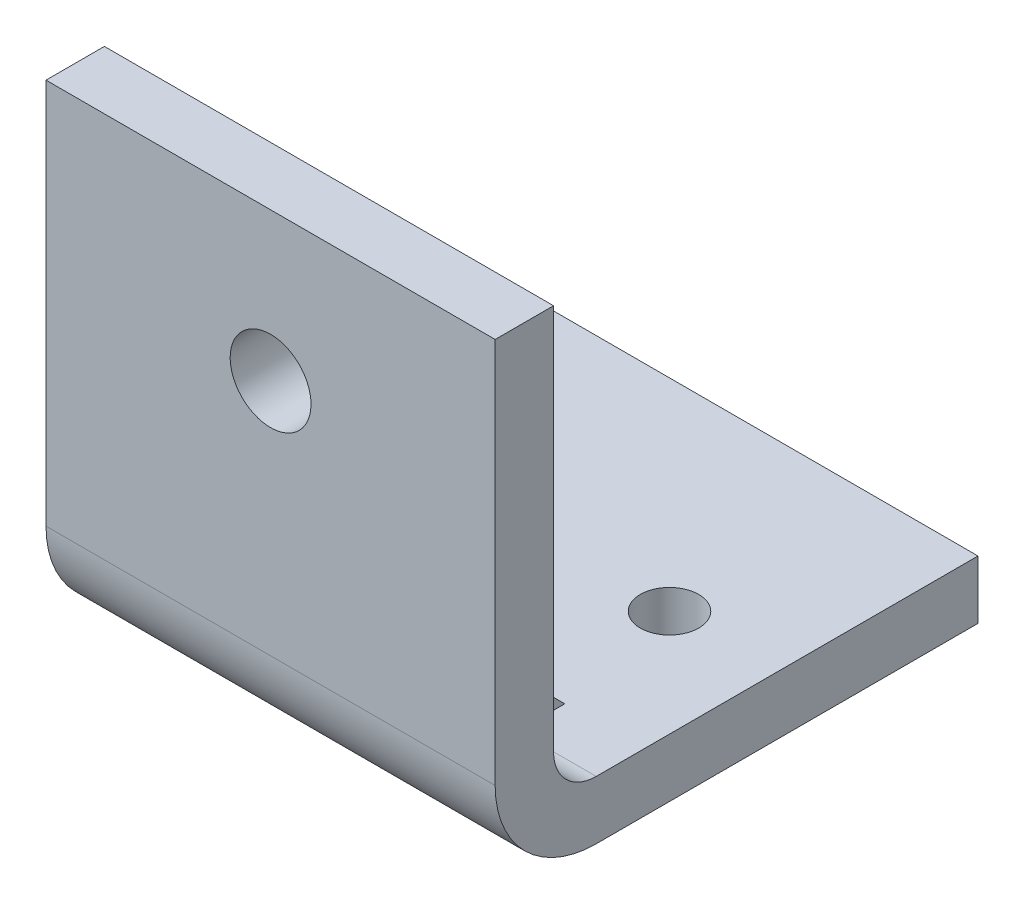
ISO-10303-21;
HEADER;
FILE_DESCRIPTION(('STEP AP214'),'2;1');
FILE_NAME('part.step','',(''),(''),'','','');
FILE_SCHEMA(('AUTOMOTIVE_DESIGN { 1 0 10303 214 1 1 1 1 }'));
ENDSEC;
DATA;
#1=APPLICATION_CONTEXT('core data for automotive mechanical design processes');
#2=APPLICATION_PROTOCOL_DEFINITION('international standard','automotive_design',2000,#1);
#3=PRODUCT_CONTEXT('',#1,'mechanical');
#4=PRODUCT('Part','Part','',(#3));
#5=PRODUCT_RELATED_PRODUCT_CATEGORY('part','',(#4));
#6=PRODUCT_DEFINITION_FORMATION('','',#4);
#7=PRODUCT_DEFINITION_CONTEXT('part definition',#1,'design');
#8=PRODUCT_DEFINITION('design','',#6,#7);
#9=PRODUCT_DEFINITION_SHAPE('','',#8);
#10=(LENGTH_UNIT() NAMED_UNIT(*) SI_UNIT(.MILLI.,.METRE.));
#11=(NAMED_UNIT(*) PLANE_ANGLE_UNIT() SI_UNIT($,.RADIAN.));
#12=(NAMED_UNIT(*) SI_UNIT($,.STERADIAN.) SOLID_ANGLE_UNIT());
#13=UNCERTAINTY_MEASURE_WITH_UNIT(LENGTH_MEASURE(1.E-05),#10,'distance_accuracy_value','');
#14=(GEOMETRIC_REPRESENTATION_CONTEXT(3) GLOBAL_UNCERTAINTY_ASSIGNED_CONTEXT((#13)) GLOBAL_UNIT_ASSIGNED_CONTEXT((#10,
#11,#12)) REPRESENTATION_CONTEXT('',''));
#15=CARTESIAN_POINT('',(0.,0.,0.));
#16=DIRECTION('',(0.,0.,1.));
#17=DIRECTION('',(1.,0.,0.));
#18=AXIS2_PLACEMENT_3D('',#15,#16,#17);
#19=CARTESIAN_POINT('',(50.,16.,-16.));
#20=DIRECTION('',(-1.,0.,0.));
#21=DIRECTION('',(0.,0.,1.));
#22=AXIS2_PLACEMENT_3D('',#19,#20,#21);
#23=CYLINDRICAL_SURFACE('',#22,9.5);
#24=DIRECTION('',(-1.,0.,0.));
#25=VECTOR('',#24,1.);
#26=CARTESIAN_POINT('',(50.,6.5,-16.0000000000001));
#27=LINE('',#26,#25);
#28=CARTESIAN_POINT('',(27.5,6.5,-16.0000000000001));
#29=VERTEX_POINT('',#28);
#30=CARTESIAN_POINT('',(-27.5,6.5,-16.0000000000001));
#31=VERTEX_POINT('',#30);
#32=EDGE_CURVE('E326',#29,#31,#27,.T.);
#33=ORIENTED_EDGE('',*,*,#32,.T.);
#34=CARTESIAN_POINT('',(-27.5,16.,-16.));
#35=DIRECTION('',(-1.,0.,0.));
#36=DIRECTION('',(0.,0.,1.));
#37=AXIS2_PLACEMENT_3D('',#34,#35,#36);
#38=CIRCLE('',#37,9.5);
#39=CARTESIAN_POINT('',(-27.5,16.0000000000001,-6.5));
#40=VERTEX_POINT('',#39);
#41=EDGE_CURVE('E157',#31,#40,#38,.T.);
#42=ORIENTED_EDGE('',*,*,#41,.T.);
#43=DIRECTION('',(-1.,0.,0.));
#44=VECTOR('',#43,1.);
#45=CARTESIAN_POINT('',(50.,16.0000000000001,-6.5));
#46=LINE('',#45,#44);
#47=CARTESIAN_POINT('',(27.5,16.0000000000001,-6.5));
#48=VERTEX_POINT('',#47);
#49=EDGE_CURVE('E322',#48,#40,#46,.T.);
#50=ORIENTED_EDGE('',*,*,#49,.F.);
#51=CARTESIAN_POINT('',(27.5,16.,-16.));
#52=DIRECTION('',(1.,0.,0.));
#53=DIRECTION('',(0.,0.,-1.));
#54=AXIS2_PLACEMENT_3D('',#51,#52,#53);
#55=CIRCLE('',#54,9.5);
#56=EDGE_CURVE('E67',#48,#29,#55,.T.);
#57=ORIENTED_EDGE('',*,*,#56,.T.);
#58=EDGE_LOOP('',(#33,#42,#50,#57));
#59=FACE_BOUND('',#58,.T.);
#60=ADVANCED_FACE('F43',(#59),#23,.F.);
#61=CARTESIAN_POINT('',(-32.5,16.,-16.));
#62=DIRECTION('',(-1.,0.,0.));
#63=DIRECTION('',(0.,0.,1.));
#64=AXIS2_PLACEMENT_3D('',#61,#62,#63);
#65=CIRCLE('',#64,9.5);
#66=CARTESIAN_POINT('',(-32.5,6.5,-16.0000000000001));
#67=VERTEX_POINT('',#66);
#68=CARTESIAN_POINT('',(-32.5,16.0000000000001,-6.5));
#69=VERTEX_POINT('',#68);
#70=EDGE_CURVE('E344',#67,#69,#65,.T.);
#71=ORIENTED_EDGE('',*,*,#70,.F.);
#72=CARTESIAN_POINT('',(-50.,6.5,-16.0000000000001));
#73=VERTEX_POINT('',#72);
#74=EDGE_CURVE('E321',#67,#73,#27,.T.);
#75=ORIENTED_EDGE('',*,*,#74,.T.);
#76=CARTESIAN_POINT('',(-50.,16.,-16.));
#77=DIRECTION('',(1.,0.,0.));
#78=DIRECTION('',(0.,0.,-1.));
#79=AXIS2_PLACEMENT_3D('',#76,#77,#78);
#80=CIRCLE('',#79,9.5);
#81=CARTESIAN_POINT('',(-50.,16.0000000000001,-6.5));
#82=VERTEX_POINT('',#81);
#83=EDGE_CURVE('E286',#82,#73,#80,.T.);
#84=ORIENTED_EDGE('',*,*,#83,.F.);
#85=EDGE_CURVE('E316',#69,#82,#46,.T.);
#86=ORIENTED_EDGE('',*,*,#85,.F.);
#87=EDGE_LOOP('',(#71,#75,#84,#86));
#88=FACE_BOUND('',#87,.T.);
#89=ADVANCED_FACE('F343',(#88),#23,.F.);
#90=CARTESIAN_POINT('',(50.,-6.5,-16.0000000000001));
#91=DIRECTION('',(0.,1.,0.));
#92=DIRECTION('',(0.,0.,1.));
#93=AXIS2_PLACEMENT_3D('',#90,#91,#92);
#94=PLANE('',#93);
#95=DIRECTION('',(-1.,0.,0.));
#96=VECTOR('',#95,1.);
#97=CARTESIAN_POINT('',(50.,-6.5,-16.0000000000001));
#98=LINE('',#97,#96);
#99=CARTESIAN_POINT('',(50.,-6.5,-16.0000000000001));
#100=VERTEX_POINT('',#99);
#101=CARTESIAN_POINT('',(-50.,-6.5,-16.0000000000001));
#102=VERTEX_POINT('',#101);
#103=EDGE_CURVE('E274',#100,#102,#98,.T.);
#104=ORIENTED_EDGE('',*,*,#103,.T.);
#105=DIRECTION('',(0.,0.,-1.));
#106=VECTOR('',#105,1.);
#107=CARTESIAN_POINT('',(-50.,-6.5,-16.0000000000001));
#108=LINE('',#107,#106);
#109=CARTESIAN_POINT('',(-50.,-6.5,-101.));
#110=VERTEX_POINT('',#109);
#111=EDGE_CURVE('E240',#102,#110,#108,.T.);
#112=ORIENTED_EDGE('',*,*,#111,.T.);
#113=DIRECTION('',(-1.,0.,0.));
#114=VECTOR('',#113,1.);
#115=CARTESIAN_POINT('',(50.,-6.5,-101.));
#116=LINE('',#115,#114);
#117=CARTESIAN_POINT('',(50.,-6.5,-101.));
#118=VERTEX_POINT('',#117);
#119=EDGE_CURVE('E11',#118,#110,#116,.T.);
#120=ORIENTED_EDGE('',*,*,#119,.F.);
#121=DIRECTION('',(0.,0.,-1.));
#122=VECTOR('',#121,1.);
#123=CARTESIAN_POINT('',(50.,-6.5,-16.0000000000001));
#124=LINE('',#123,#122);
#125=EDGE_CURVE('E244',#100,#118,#124,.T.);
#126=ORIENTED_EDGE('',*,*,#125,.F.);
#127=EDGE_LOOP('',(#104,#112,#120,#126));
#128=FACE_BOUND('',#127,.T.);
#129=CARTESIAN_POINT('',(26.3164053451294,-6.5,-56.));
#130=DIRECTION('',(0.,1.,0.));
#131=DIRECTION('',(0.,0.,1.));
#132=AXIS2_PLACEMENT_3D('',#129,#130,#131);
#133=CIRCLE('',#132,6.5);
#134=CARTESIAN_POINT('',(26.3164053451294,-6.5,-49.5));
#135=VERTEX_POINT('',#134);
#136=EDGE_CURVE('E220',#135,#135,#133,.T.);
#137=ORIENTED_EDGE('',*,*,#136,.T.);
#138=EDGE_LOOP('',(#137));
#139=FACE_BOUND('',#138,.T.);
#140=CARTESIAN_POINT('',(-23.6835946548706,-6.5,-56.));
#141=DIRECTION('',(0.,1.,0.));
#142=DIRECTION('',(0.,0.,1.));
#143=AXIS2_PLACEMENT_3D('',#140,#141,#142);
#144=CIRCLE('',#143,6.5);
#145=CARTESIAN_POINT('',(-23.6835946548706,-6.5,-49.5));
#146=VERTEX_POINT('',#145);
#147=EDGE_CURVE('E219',#146,#146,#144,.T.);
#148=ORIENTED_EDGE('',*,*,#147,.T.);
#149=EDGE_LOOP('',(#148));
#150=FACE_BOUND('',#149,.T.);
#151=ADVANCED_FACE('F45',(#128,#139,#150),#94,.F.);
#152=CARTESIAN_POINT('',(50.,6.5,-101.));
#153=DIRECTION('',(0.,0.,-1.));
#154=DIRECTION('',(-1.,0.,0.));
#155=AXIS2_PLACEMENT_3D('',#152,#153,#154);
#156=PLANE('',#155);
#157=DIRECTION('',(0.,-1.,0.));
#158=VECTOR('',#157,1.);
#159=CARTESIAN_POINT('',(-50.,6.5,-101.));
#160=LINE('',#159,#158);
#161=CARTESIAN_POINT('',(-50.,6.5,-101.));
#162=VERTEX_POINT('',#161);
#163=EDGE_CURVE('E278',#162,#110,#160,.T.);
#164=ORIENTED_EDGE('',*,*,#163,.F.);
#165=DIRECTION('',(-1.,0.,0.));
#166=VECTOR('',#165,1.);
#167=CARTESIAN_POINT('',(50.,6.5,-101.));
#168=LINE('',#167,#166);
#169=CARTESIAN_POINT('',(50.,6.5,-101.));
#170=VERTEX_POINT('',#169);
#171=EDGE_CURVE('E52',#170,#162,#168,.T.);
#172=ORIENTED_EDGE('',*,*,#171,.F.);
#173=DIRECTION('',(0.,-1.,0.));
#174=VECTOR('',#173,1.);
#175=CARTESIAN_POINT('',(50.,6.5,-101.));
#176=LINE('',#175,#174);
#177=EDGE_CURVE('E247',#170,#118,#176,.T.);
#178=ORIENTED_EDGE('',*,*,#177,.T.);
#179=ORIENTED_EDGE('',*,*,#119,.T.);
#180=EDGE_LOOP('',(#164,#172,#178,#179));
#181=FACE_BOUND('',#180,.T.);
#182=ADVANCED_FACE('F333',(#181),#156,.T.);
#183=CARTESIAN_POINT('',(50.,6.5,-16.0000000000001));
#184=DIRECTION('',(0.,1.,0.));
#185=DIRECTION('',(0.,0.,1.));
#186=AXIS2_PLACEMENT_3D('',#183,#184,#185);
#187=PLANE('',#186);
#188=DIRECTION('',(0.,0.,1.));
#189=VECTOR('',#188,1.);
#190=CARTESIAN_POINT('',(-32.5,6.5,-16.0000000000001));
#191=LINE('',#190,#189);
#192=CARTESIAN_POINT('',(-32.5,6.5,-26.5));
#193=VERTEX_POINT('',#192);
#194=EDGE_CURVE('E180',#193,#67,#191,.T.);
#195=ORIENTED_EDGE('',*,*,#194,.F.);
#196=DIRECTION('',(-1.,0.,0.));
#197=VECTOR('',#196,1.);
#198=CARTESIAN_POINT('',(50.,6.5,-26.5));
#199=LINE('',#198,#197);
#200=CARTESIAN_POINT('',(-27.5,6.5,-26.5));
#201=VERTEX_POINT('',#200);
#202=EDGE_CURVE('E168',#201,#193,#199,.T.);
#203=ORIENTED_EDGE('',*,*,#202,.F.);
#204=DIRECTION('',(0.,0.,1.));
#205=VECTOR('',#204,1.);
#206=CARTESIAN_POINT('',(-27.5,6.5,-16.0000000000001));
#207=LINE('',#206,#205);
#208=EDGE_CURVE('E154',#201,#31,#207,.T.);
#209=ORIENTED_EDGE('',*,*,#208,.T.);
#210=ORIENTED_EDGE('',*,*,#32,.F.);
#211=DIRECTION('',(0.,0.,-1.));
#212=VECTOR('',#211,1.);
#213=CARTESIAN_POINT('',(27.5,6.5,-16.0000000000001));
#214=LINE('',#213,#212);
#215=CARTESIAN_POINT('',(27.5,6.5,-26.5));
#216=VERTEX_POINT('',#215);
#217=EDGE_CURVE('E200',#29,#216,#214,.T.);
#218=ORIENTED_EDGE('',*,*,#217,.T.);
#219=DIRECTION('',(1.,0.,0.));
#220=VECTOR('',#219,1.);
#221=CARTESIAN_POINT('',(50.,6.5,-26.5));
#222=LINE('',#221,#220);
#223=CARTESIAN_POINT('',(32.5,6.5,-26.5));
#224=VERTEX_POINT('',#223);
#225=EDGE_CURVE('E216',#224,#216,#222,.F.);
#226=ORIENTED_EDGE('',*,*,#225,.F.);
#227=DIRECTION('',(0.,0.,-1.));
#228=VECTOR('',#227,1.);
#229=CARTESIAN_POINT('',(32.5,6.5,-16.0000000000001));
#230=LINE('',#229,#228);
#231=CARTESIAN_POINT('',(32.5,6.5,-16.0000000000001));
#232=VERTEX_POINT('',#231);
#233=EDGE_CURVE('E210',#232,#224,#230,.T.);
#234=ORIENTED_EDGE('',*,*,#233,.F.);
#235=CARTESIAN_POINT('',(50.,6.5,-16.0000000000001));
#236=VERTEX_POINT('',#235);
#237=EDGE_CURVE('E323',#236,#232,#27,.T.);
#238=ORIENTED_EDGE('',*,*,#237,.F.);
#239=DIRECTION('',(0.,0.,-1.));
#240=VECTOR('',#239,1.);
#241=CARTESIAN_POINT('',(50.,6.5,-16.0000000000001));
#242=LINE('',#241,#240);
#243=EDGE_CURVE('E252',#236,#170,#242,.T.);
#244=ORIENTED_EDGE('',*,*,#243,.T.);
#245=ORIENTED_EDGE('',*,*,#171,.T.);
#246=DIRECTION('',(0.,0.,-1.));
#247=VECTOR('',#246,1.);
#248=CARTESIAN_POINT('',(-50.,6.5,-16.0000000000001));
#249=LINE('',#248,#247);
#250=EDGE_CURVE('E282',#73,#162,#249,.T.);
#251=ORIENTED_EDGE('',*,*,#250,.F.);
#252=ORIENTED_EDGE('',*,*,#74,.F.);
#253=EDGE_LOOP('',(#195,#203,#209,#210,#218,#226,#234,#238,#244,#245,#251,#252));
#254=FACE_BOUND('',#253,.T.);
#255=CARTESIAN_POINT('',(26.3164053451294,6.5,-56.));
#256=DIRECTION('',(0.,1.,0.));
#257=DIRECTION('',(0.,0.,1.));
#258=AXIS2_PLACEMENT_3D('',#255,#256,#257);
#259=CIRCLE('',#258,6.5);
#260=CARTESIAN_POINT('',(26.3164053451294,6.5,-49.5));
#261=VERTEX_POINT('',#260);
#262=EDGE_CURVE('E225',#261,#261,#259,.T.);
#263=ORIENTED_EDGE('',*,*,#262,.F.);
#264=EDGE_LOOP('',(#263));
#265=FACE_BOUND('',#264,.T.);
#266=CARTESIAN_POINT('',(-23.6835946548706,6.5,-56.));
#267=DIRECTION('',(0.,1.,0.));
#268=DIRECTION('',(0.,0.,1.));
#269=AXIS2_PLACEMENT_3D('',#266,#267,#268);
#270=CIRCLE('',#269,6.5);
#271=CARTESIAN_POINT('',(-23.6835946548706,6.5,-49.5));
#272=VERTEX_POINT('',#271);
#273=EDGE_CURVE('E229',#272,#272,#270,.T.);
#274=ORIENTED_EDGE('',*,*,#273,.F.);
#275=EDGE_LOOP('',(#274));
#276=FACE_BOUND('',#275,.T.);
#277=ADVANCED_FACE('F177',(#254,#265,#276),#187,.T.);
#278=CARTESIAN_POINT('',(32.5,16.,-16.));
#279=DIRECTION('',(1.,0.,0.));
#280=DIRECTION('',(0.,0.,-1.));
#281=AXIS2_PLACEMENT_3D('',#278,#279,#280);
#282=CIRCLE('',#281,9.5);
#283=CARTESIAN_POINT('',(32.5,16.0000000000001,-6.5));
#284=VERTEX_POINT('',#283);
#285=EDGE_CURVE('E207',#284,#232,#282,.T.);
#286=ORIENTED_EDGE('',*,*,#285,.F.);
#287=CARTESIAN_POINT('',(50.,16.0000000000001,-6.5));
#288=VERTEX_POINT('',#287);
#289=EDGE_CURVE('E317',#288,#284,#46,.T.);
#290=ORIENTED_EDGE('',*,*,#289,.F.);
#291=CARTESIAN_POINT('',(50.,16.,-16.));
#292=DIRECTION('',(1.,0.,0.));
#293=DIRECTION('',(0.,0.,-1.));
#294=AXIS2_PLACEMENT_3D('',#291,#292,#293);
#295=CIRCLE('',#294,9.5);
#296=EDGE_CURVE('E256',#288,#236,#295,.T.);
#297=ORIENTED_EDGE('',*,*,#296,.T.);
#298=ORIENTED_EDGE('',*,*,#237,.T.);
#299=EDGE_LOOP('',(#286,#290,#297,#298));
#300=FACE_BOUND('',#299,.T.);
#301=ADVANCED_FACE('F367',(#300),#23,.F.);
#302=CARTESIAN_POINT('',(50.,102.,-6.5));
#303=DIRECTION('',(0.,0.,-1.));
#304=DIRECTION('',(0.,1.,0.));
#305=AXIS2_PLACEMENT_3D('',#302,#303,#304);
#306=PLANE('',#305);
#307=DIRECTION('',(0.,1.,0.));
#308=VECTOR('',#307,1.);
#309=CARTESIAN_POINT('',(-32.5,102.,-6.5));
#310=LINE('',#309,#308);
#311=CARTESIAN_POINT('',(-32.5,26.5,-6.5));
#312=VERTEX_POINT('',#311);
#313=EDGE_CURVE('E163',#69,#312,#310,.T.);
#314=ORIENTED_EDGE('',*,*,#313,.F.);
#315=ORIENTED_EDGE('',*,*,#85,.T.);
#316=DIRECTION('',(0.,-1.,0.));
#317=VECTOR('',#316,1.);
#318=CARTESIAN_POINT('',(-50.,102.,-6.5));
#319=LINE('',#318,#317);
#320=CARTESIAN_POINT('',(-50.,102.,-6.5));
#321=VERTEX_POINT('',#320);
#322=EDGE_CURVE('E290',#321,#82,#319,.T.);
#323=ORIENTED_EDGE('',*,*,#322,.F.);
#324=DIRECTION('',(-1.,0.,0.));
#325=VECTOR('',#324,1.);
#326=CARTESIAN_POINT('',(50.,102.,-6.5));
#327=LINE('',#326,#325);
#328=CARTESIAN_POINT('',(50.,102.,-6.5));
#329=VERTEX_POINT('',#328);
#330=EDGE_CURVE('E313',#329,#321,#327,.T.);
#331=ORIENTED_EDGE('',*,*,#330,.F.);
#332=DIRECTION('',(0.,-1.,0.));
#333=VECTOR('',#332,1.);
#334=CARTESIAN_POINT('',(50.,102.,-6.5));
#335=LINE('',#334,#333);
#336=EDGE_CURVE('E260',#329,#288,#335,.T.);
#337=ORIENTED_EDGE('',*,*,#336,.T.);
#338=ORIENTED_EDGE('',*,*,#289,.T.);
#339=DIRECTION('',(0.,-1.,0.));
#340=VECTOR('',#339,1.);
#341=CARTESIAN_POINT('',(32.5,102.,-6.5));
#342=LINE('',#341,#340);
#343=CARTESIAN_POINT('',(32.5,26.5,-6.5));
#344=VERTEX_POINT('',#343);
#345=EDGE_CURVE('E204',#344,#284,#342,.T.);
#346=ORIENTED_EDGE('',*,*,#345,.F.);
#347=DIRECTION('',(-1.,0.,0.));
#348=VECTOR('',#347,1.);
#349=CARTESIAN_POINT('',(50.,26.5,-6.5));
#350=LINE('',#349,#348);
#351=CARTESIAN_POINT('',(27.5,26.5,-6.5));
#352=VERTEX_POINT('',#351);
#353=EDGE_CURVE('E213',#352,#344,#350,.F.);
#354=ORIENTED_EDGE('',*,*,#353,.F.);
#355=DIRECTION('',(0.,-1.,0.));
#356=VECTOR('',#355,1.);
#357=CARTESIAN_POINT('',(27.5,102.,-6.5));
#358=LINE('',#357,#356);
#359=EDGE_CURVE('E194',#352,#48,#358,.T.);
#360=ORIENTED_EDGE('',*,*,#359,.T.);
#361=ORIENTED_EDGE('',*,*,#49,.T.);
#362=DIRECTION('',(0.,1.,0.));
#363=VECTOR('',#362,1.);
#364=CARTESIAN_POINT('',(-27.5,102.,-6.5));
#365=LINE('',#364,#363);
#366=CARTESIAN_POINT('',(-27.5,26.5,-6.5));
#367=VERTEX_POINT('',#366);
#368=EDGE_CURVE('E392',#40,#367,#365,.T.);
#369=ORIENTED_EDGE('',*,*,#368,.T.);
#370=DIRECTION('',(1.,0.,0.));
#371=VECTOR('',#370,1.);
#372=CARTESIAN_POINT('',(50.,26.5,-6.5));
#373=LINE('',#372,#371);
#374=EDGE_CURVE('E171',#312,#367,#373,.T.);
#375=ORIENTED_EDGE('',*,*,#374,.F.);
#376=EDGE_LOOP('',(#314,#315,#323,#331,#337,#338,#346,#354,#360,#361,#369,#375));
#377=FACE_BOUND('',#376,.T.);
#378=CARTESIAN_POINT('',(0.,69.,-6.5));
#379=DIRECTION('',(0.,0.,-1.));
#380=DIRECTION('',(0.,1.,0.));
#381=AXIS2_PLACEMENT_3D('',#378,#379,#380);
#382=CIRCLE('',#381,9.);
#383=CARTESIAN_POINT('',(0.,78.,-6.5));
#384=VERTEX_POINT('',#383);
#385=EDGE_CURVE('E224',#384,#384,#382,.T.);
#386=ORIENTED_EDGE('',*,*,#385,.F.);
#387=EDGE_LOOP('',(#386));
#388=FACE_BOUND('',#387,.T.);
#389=ADVANCED_FACE('F361',(#377,#388),#306,.T.);
#390=CARTESIAN_POINT('',(50.,102.,6.5));
#391=DIRECTION('',(0.,1.,0.));
#392=DIRECTION('',(0.,0.,1.));
#393=AXIS2_PLACEMENT_3D('',#390,#391,#392);
#394=PLANE('',#393);
#395=DIRECTION('',(0.,0.,-1.));
#396=VECTOR('',#395,1.);
#397=CARTESIAN_POINT('',(-50.,102.,6.5));
#398=LINE('',#397,#396);
#399=CARTESIAN_POINT('',(-50.,102.,6.5));
#400=VERTEX_POINT('',#399);
#401=EDGE_CURVE('E294',#400,#321,#398,.T.);
#402=ORIENTED_EDGE('',*,*,#401,.F.);
#403=DIRECTION('',(-1.,0.,0.));
#404=VECTOR('',#403,1.);
#405=CARTESIAN_POINT('',(50.,102.,6.5));
#406=LINE('',#405,#404);
#407=CARTESIAN_POINT('',(50.,102.,6.5));
#408=VERTEX_POINT('',#407);
#409=EDGE_CURVE('E310',#408,#400,#406,.T.);
#410=ORIENTED_EDGE('',*,*,#409,.F.);
#411=DIRECTION('',(0.,0.,-1.));
#412=VECTOR('',#411,1.);
#413=CARTESIAN_POINT('',(50.,102.,6.5));
#414=LINE('',#413,#412);
#415=EDGE_CURVE('E264',#408,#329,#414,.T.);
#416=ORIENTED_EDGE('',*,*,#415,.T.);
#417=ORIENTED_EDGE('',*,*,#330,.T.);
#418=EDGE_LOOP('',(#402,#410,#416,#417));
#419=FACE_BOUND('',#418,.T.);
#420=ADVANCED_FACE('F389',(#419),#394,.T.);
#421=CARTESIAN_POINT('',(50.,102.,6.5));
#422=DIRECTION('',(0.,0.,-1.));
#423=DIRECTION('',(0.,1.,0.));
#424=AXIS2_PLACEMENT_3D('',#421,#422,#423);
#425=PLANE('',#424);
#426=DIRECTION('',(0.,-1.,0.));
#427=VECTOR('',#426,1.);
#428=CARTESIAN_POINT('',(-50.,102.,6.5));
#429=LINE('',#428,#427);
#430=CARTESIAN_POINT('',(-50.,16.0000000000002,6.5));
#431=VERTEX_POINT('',#430);
#432=EDGE_CURVE('E298',#400,#431,#429,.T.);
#433=ORIENTED_EDGE('',*,*,#432,.T.);
#434=DIRECTION('',(-1.,0.,0.));
#435=VECTOR('',#434,1.);
#436=CARTESIAN_POINT('',(50.,16.0000000000002,6.5));
#437=LINE('',#436,#435);
#438=CARTESIAN_POINT('',(50.,16.0000000000002,6.5));
#439=VERTEX_POINT('',#438);
#440=EDGE_CURVE('E307',#439,#431,#437,.T.);
#441=ORIENTED_EDGE('',*,*,#440,.F.);
#442=DIRECTION('',(0.,-1.,0.));
#443=VECTOR('',#442,1.);
#444=CARTESIAN_POINT('',(50.,102.,6.5));
#445=LINE('',#444,#443);
#446=EDGE_CURVE('E268',#408,#439,#445,.T.);
#447=ORIENTED_EDGE('',*,*,#446,.F.);
#448=ORIENTED_EDGE('',*,*,#409,.T.);
#449=EDGE_LOOP('',(#433,#441,#447,#448));
#450=FACE_BOUND('',#449,.T.);
#451=CARTESIAN_POINT('',(0.,69.,6.50000000000001));
#452=DIRECTION('',(0.,0.,-1.));
#453=DIRECTION('',(0.,1.,0.));
#454=AXIS2_PLACEMENT_3D('',#451,#452,#453);
#455=CIRCLE('',#454,9.);
#456=CARTESIAN_POINT('',(0.,78.,6.50000000000001));
#457=VERTEX_POINT('',#456);
#458=EDGE_CURVE('E236',#457,#457,#455,.T.);
#459=ORIENTED_EDGE('',*,*,#458,.T.);
#460=EDGE_LOOP('',(#459));
#461=FACE_BOUND('',#460,.T.);
#462=ADVANCED_FACE('F385',(#450,#461),#425,.F.);
#463=CARTESIAN_POINT('',(50.,16.,-16.));
#464=DIRECTION('',(-1.,0.,0.));
#465=DIRECTION('',(0.,0.,1.));
#466=AXIS2_PLACEMENT_3D('',#463,#464,#465);
#467=CYLINDRICAL_SURFACE('',#466,22.5);
#468=CARTESIAN_POINT('',(-50.,16.,-16.));
#469=DIRECTION('',(1.,0.,0.));
#470=DIRECTION('',(0.,0.,-1.));
#471=AXIS2_PLACEMENT_3D('',#468,#469,#470);
#472=CIRCLE('',#471,22.5);
#473=EDGE_CURVE('E248',#431,#102,#472,.T.);
#474=ORIENTED_EDGE('',*,*,#473,.T.);
#475=ORIENTED_EDGE('',*,*,#103,.F.);
#476=CARTESIAN_POINT('',(50.,16.,-16.));
#477=DIRECTION('',(1.,0.,0.));
#478=DIRECTION('',(0.,0.,-1.));
#479=AXIS2_PLACEMENT_3D('',#476,#477,#478);
#480=CIRCLE('',#479,22.5);
#481=EDGE_CURVE('E271',#439,#100,#480,.T.);
#482=ORIENTED_EDGE('',*,*,#481,.F.);
#483=ORIENTED_EDGE('',*,*,#440,.T.);
#484=EDGE_LOOP('',(#474,#475,#482,#483));
#485=FACE_BOUND('',#484,.T.);
#486=ADVANCED_FACE('F381',(#485),#467,.T.);
#487=CARTESIAN_POINT('',(50.,16.,-16.));
#488=DIRECTION('',(1.,0.,0.));
#489=DIRECTION('',(0.,0.,-1.));
#490=AXIS2_PLACEMENT_3D('',#487,#488,#489);
#491=PLANE('',#490);
#492=ORIENTED_EDGE('',*,*,#125,.T.);
#493=ORIENTED_EDGE('',*,*,#177,.F.);
#494=ORIENTED_EDGE('',*,*,#243,.F.);
#495=ORIENTED_EDGE('',*,*,#296,.F.);
#496=ORIENTED_EDGE('',*,*,#336,.F.);
#497=ORIENTED_EDGE('',*,*,#415,.F.);
#498=ORIENTED_EDGE('',*,*,#446,.T.);
#499=ORIENTED_EDGE('',*,*,#481,.T.);
#500=EDGE_LOOP('',(#492,#493,#494,#495,#496,#497,#498,#499));
#501=FACE_BOUND('',#500,.T.);
#502=ADVANCED_FACE('F370',(#501),#491,.T.);
#503=CARTESIAN_POINT('',(-50.,16.,-16.));
#504=DIRECTION('',(1.,0.,0.));
#505=DIRECTION('',(0.,0.,-1.));
#506=AXIS2_PLACEMENT_3D('',#503,#504,#505);
#507=PLANE('',#506);
#508=ORIENTED_EDGE('',*,*,#111,.F.);
#509=ORIENTED_EDGE('',*,*,#473,.F.);
#510=ORIENTED_EDGE('',*,*,#432,.F.);
#511=ORIENTED_EDGE('',*,*,#401,.T.);
#512=ORIENTED_EDGE('',*,*,#322,.T.);
#513=ORIENTED_EDGE('',*,*,#83,.T.);
#514=ORIENTED_EDGE('',*,*,#250,.T.);
#515=ORIENTED_EDGE('',*,*,#163,.T.);
#516=EDGE_LOOP('',(#508,#509,#510,#511,#512,#513,#514,#515));
#517=FACE_BOUND('',#516,.T.);
#518=ADVANCED_FACE('F337',(#517),#507,.F.);
#519=CARTESIAN_POINT('',(0.,69.,6.50000000000001));
#520=DIRECTION('',(0.,0.,-1.));
#521=DIRECTION('',(0.,1.,0.));
#522=AXIS2_PLACEMENT_3D('',#519,#520,#521);
#523=CYLINDRICAL_SURFACE('',#522,9.);
#524=ORIENTED_EDGE('',*,*,#458,.F.);
#525=EDGE_LOOP('',(#524));
#526=FACE_BOUND('',#525,.T.);
#527=ORIENTED_EDGE('',*,*,#385,.T.);
#528=EDGE_LOOP('',(#527));
#529=FACE_BOUND('',#528,.T.);
#530=ADVANCED_FACE('F546',(#526,#529),#523,.F.);
#531=CARTESIAN_POINT('',(-23.6835946548706,-6.5,-56.));
#532=DIRECTION('',(0.,1.,0.));
#533=DIRECTION('',(0.,0.,1.));
#534=AXIS2_PLACEMENT_3D('',#531,#532,#533);
#535=CYLINDRICAL_SURFACE('',#534,6.5);
#536=ORIENTED_EDGE('',*,*,#147,.F.);
#537=EDGE_LOOP('',(#536));
#538=FACE_BOUND('',#537,.T.);
#539=ORIENTED_EDGE('',*,*,#273,.T.);
#540=EDGE_LOOP('',(#539));
#541=FACE_BOUND('',#540,.T.);
#542=ADVANCED_FACE('F556',(#538,#541),#535,.F.);
#543=CARTESIAN_POINT('',(26.3164053451294,-6.5,-56.));
#544=DIRECTION('',(0.,1.,0.));
#545=DIRECTION('',(0.,0.,1.));
#546=AXIS2_PLACEMENT_3D('',#543,#544,#545);
#547=CYLINDRICAL_SURFACE('',#546,6.5);
#548=ORIENTED_EDGE('',*,*,#136,.F.);
#549=EDGE_LOOP('',(#548));
#550=FACE_BOUND('',#549,.T.);
#551=ORIENTED_EDGE('',*,*,#262,.T.);
#552=EDGE_LOOP('',(#551));
#553=FACE_BOUND('',#552,.T.);
#554=ADVANCED_FACE('F450',(#550,#553),#547,.F.);
#555=CARTESIAN_POINT('',(30.,26.5,-6.5));
#556=DIRECTION('',(0.,-0.707106781186547,0.707106781186548));
#557=DIRECTION('',(0.,-0.707106781186548,-0.707106781186547));
#558=AXIS2_PLACEMENT_3D('',#555,#556,#557);
#559=PLANE('',#558);
#560=DIRECTION('',(0.,-0.707106781186548,-0.707106781186547));
#561=VECTOR('',#560,1.);
#562=CARTESIAN_POINT('',(32.5,26.5,-6.5));
#563=LINE('',#562,#561);
#564=EDGE_CURVE('E187',#344,#224,#563,.T.);
#565=ORIENTED_EDGE('',*,*,#564,.T.);
#566=ORIENTED_EDGE('',*,*,#225,.T.);
#567=DIRECTION('',(0.,-0.707106781186548,-0.707106781186547));
#568=VECTOR('',#567,1.);
#569=CARTESIAN_POINT('',(27.5,26.5,-6.5));
#570=LINE('',#569,#568);
#571=EDGE_CURVE('E182',#352,#216,#570,.T.);
#572=ORIENTED_EDGE('',*,*,#571,.F.);
#573=ORIENTED_EDGE('',*,*,#353,.T.);
#574=EDGE_LOOP('',(#565,#566,#572,#573));
#575=FACE_BOUND('',#574,.T.);
#576=ADVANCED_FACE('F356',(#575),#559,.F.);
#577=CARTESIAN_POINT('',(32.5,47.75,-47.25));
#578=DIRECTION('',(1.,0.,0.));
#579=DIRECTION('',(0.,0.,-1.));
#580=AXIS2_PLACEMENT_3D('',#577,#578,#579);
#581=PLANE('',#580);
#582=ORIENTED_EDGE('',*,*,#285,.T.);
#583=ORIENTED_EDGE('',*,*,#233,.T.);
#584=ORIENTED_EDGE('',*,*,#564,.F.);
#585=ORIENTED_EDGE('',*,*,#345,.T.);
#586=EDGE_LOOP('',(#582,#583,#584,#585));
#587=FACE_BOUND('',#586,.T.);
#588=ADVANCED_FACE('F365',(#587),#581,.T.);
#589=CARTESIAN_POINT('',(27.5,47.75,-47.25));
#590=DIRECTION('',(1.,0.,0.));
#591=DIRECTION('',(0.,0.,-1.));
#592=AXIS2_PLACEMENT_3D('',#589,#590,#591);
#593=PLANE('',#592);
#594=ORIENTED_EDGE('',*,*,#217,.F.);
#595=ORIENTED_EDGE('',*,*,#56,.F.);
#596=ORIENTED_EDGE('',*,*,#359,.F.);
#597=ORIENTED_EDGE('',*,*,#571,.T.);
#598=EDGE_LOOP('',(#594,#595,#596,#597));
#599=FACE_BOUND('',#598,.T.);
#600=ADVANCED_FACE('F352',(#599),#593,.F.);
#601=CARTESIAN_POINT('',(-30.,26.5,-6.5));
#602=DIRECTION('',(0.,0.707106781186547,-0.707106781186548));
#603=DIRECTION('',(0.,-0.707106781186548,-0.707106781186547));
#604=AXIS2_PLACEMENT_3D('',#601,#602,#603);
#605=PLANE('',#604);
#606=DIRECTION('',(0.,-0.707106781186548,-0.707106781186547));
#607=VECTOR('',#606,1.);
#608=CARTESIAN_POINT('',(-27.5,26.5,-6.5));
#609=LINE('',#608,#607);
#610=EDGE_CURVE('E59',#367,#201,#609,.T.);
#611=ORIENTED_EDGE('',*,*,#610,.T.);
#612=ORIENTED_EDGE('',*,*,#202,.T.);
#613=DIRECTION('',(0.,-0.707106781186548,-0.707106781186547));
#614=VECTOR('',#613,1.);
#615=CARTESIAN_POINT('',(-32.5,26.5,-6.5));
#616=LINE('',#615,#614);
#617=EDGE_CURVE('E174',#312,#193,#616,.T.);
#618=ORIENTED_EDGE('',*,*,#617,.F.);
#619=ORIENTED_EDGE('',*,*,#374,.T.);
#620=EDGE_LOOP('',(#611,#612,#618,#619));
#621=FACE_BOUND('',#620,.T.);
#622=ADVANCED_FACE('F166',(#621),#605,.T.);
#623=CARTESIAN_POINT('',(-32.5,47.75,-47.25));
#624=DIRECTION('',(-1.,0.,0.));
#625=DIRECTION('',(0.,0.,1.));
#626=AXIS2_PLACEMENT_3D('',#623,#624,#625);
#627=PLANE('',#626);
#628=ORIENTED_EDGE('',*,*,#617,.T.);
#629=ORIENTED_EDGE('',*,*,#194,.T.);
#630=ORIENTED_EDGE('',*,*,#70,.T.);
#631=ORIENTED_EDGE('',*,*,#313,.T.);
#632=EDGE_LOOP('',(#628,#629,#630,#631));
#633=FACE_BOUND('',#632,.T.);
#634=ADVANCED_FACE('F405',(#633),#627,.T.);
#635=CARTESIAN_POINT('',(-27.5,47.75,-47.25));
#636=DIRECTION('',(-1.,0.,0.));
#637=DIRECTION('',(0.,0.,1.));
#638=AXIS2_PLACEMENT_3D('',#635,#636,#637);
#639=PLANE('',#638);
#640=ORIENTED_EDGE('',*,*,#208,.F.);
#641=ORIENTED_EDGE('',*,*,#610,.F.);
#642=ORIENTED_EDGE('',*,*,#368,.F.);
#643=ORIENTED_EDGE('',*,*,#41,.F.);
#644=EDGE_LOOP('',(#640,#641,#642,#643));
#645=FACE_BOUND('',#644,.T.);
#646=ADVANCED_FACE('F155',(#645),#639,.F.);
#647=CLOSED_SHELL('',(#60,#89,#151,#182,#277,#301,#389,#420,#462,#486,#502,#518,#530,#542,#554,
#576,#588,#600,#622,#634,#646));
#648=MANIFOLD_SOLID_BREP('B2',#647);
#649=ADVANCED_BREP_SHAPE_REPRESENTATION('',(#18,#648),#14);
#650=SHAPE_DEFINITION_REPRESENTATION(#9,#649);
ENDSEC;
END-ISO-10303-21;
